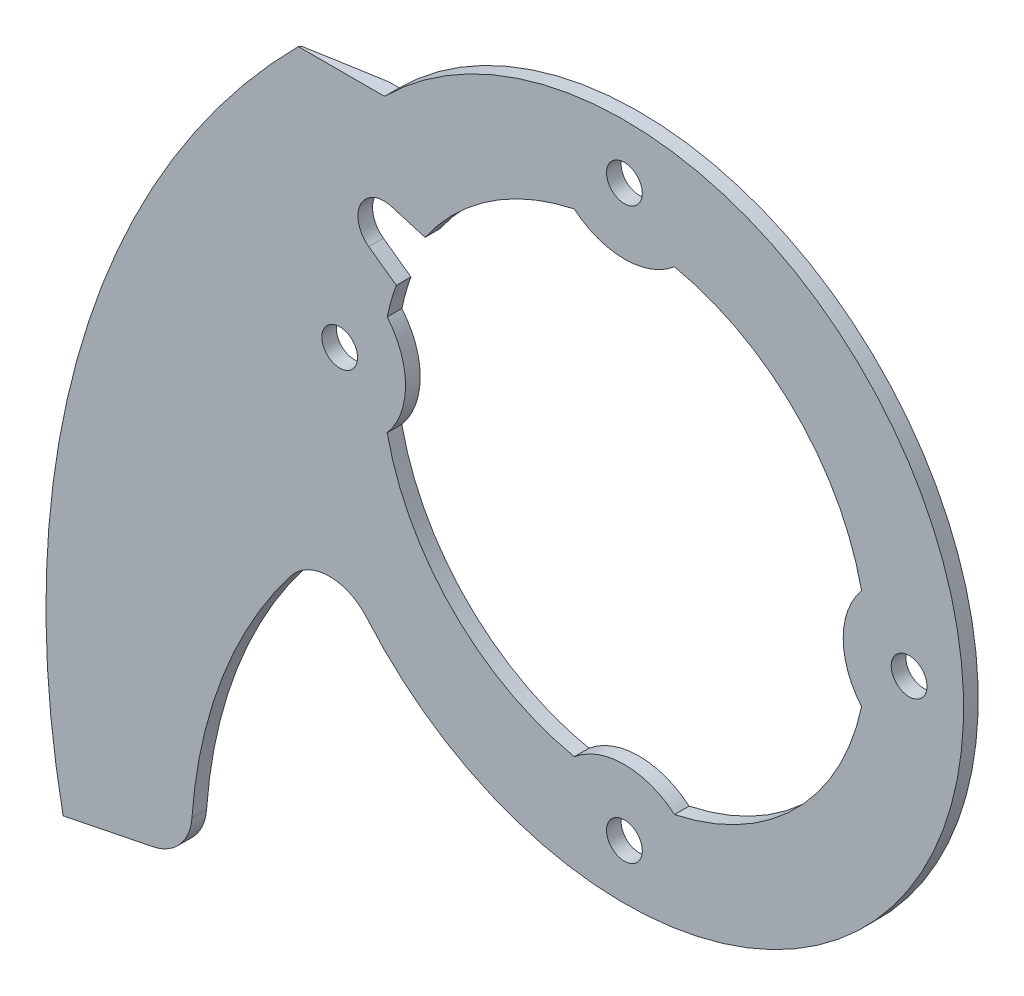
ISO-10303-21;
HEADER;
FILE_DESCRIPTION(('STEP AP214'),'2;1');
FILE_NAME('part.step','',(''),(''),'','','');
FILE_SCHEMA(('AUTOMOTIVE_DESIGN { 1 0 10303 214 1 1 1 1 }'));
ENDSEC;
DATA;
#1=APPLICATION_CONTEXT('core data for automotive mechanical design processes');
#2=APPLICATION_PROTOCOL_DEFINITION('international standard','automotive_design',2000,#1);
#3=PRODUCT_CONTEXT('',#1,'mechanical');
#4=PRODUCT('Part','Part','',(#3));
#5=PRODUCT_RELATED_PRODUCT_CATEGORY('part','',(#4));
#6=PRODUCT_DEFINITION_FORMATION('','',#4);
#7=PRODUCT_DEFINITION_CONTEXT('part definition',#1,'design');
#8=PRODUCT_DEFINITION('design','',#6,#7);
#9=PRODUCT_DEFINITION_SHAPE('','',#8);
#10=(LENGTH_UNIT() NAMED_UNIT(*) SI_UNIT(.MILLI.,.METRE.));
#11=(NAMED_UNIT(*) PLANE_ANGLE_UNIT() SI_UNIT($,.RADIAN.));
#12=(NAMED_UNIT(*) SI_UNIT($,.STERADIAN.) SOLID_ANGLE_UNIT());
#13=UNCERTAINTY_MEASURE_WITH_UNIT(LENGTH_MEASURE(1.E-05),#10,'distance_accuracy_value','');
#14=(GEOMETRIC_REPRESENTATION_CONTEXT(3) GLOBAL_UNCERTAINTY_ASSIGNED_CONTEXT((#13)) GLOBAL_UNIT_ASSIGNED_CONTEXT((#10,
#11,#12)) REPRESENTATION_CONTEXT('',''));
#15=CARTESIAN_POINT('',(0.,0.,0.));
#16=DIRECTION('',(0.,0.,1.));
#17=DIRECTION('',(1.,0.,0.));
#18=AXIS2_PLACEMENT_3D('',#15,#16,#17);
#19=CARTESIAN_POINT('',(0.,0.,0.));
#20=DIRECTION('',(0.,0.,1.));
#21=DIRECTION('',(1.,0.,0.));
#22=AXIS2_PLACEMENT_3D('',#19,#20,#21);
#23=PLANE('',#22);
#24=CARTESIAN_POINT('',(-1.83302770289265E-13,17.5,0.));
#25=DIRECTION('',(0.,0.,1.));
#26=DIRECTION('',(1.,0.,0.));
#27=AXIS2_PLACEMENT_3D('',#24,#25,#26);
#28=CIRCLE('',#27,1.1);
#29=CARTESIAN_POINT('',(1.09999999999982,17.5,0.));
#30=VERTEX_POINT('',#29);
#31=EDGE_CURVE('E196',#30,#30,#28,.T.);
#32=ORIENTED_EDGE('',*,*,#31,.T.);
#33=EDGE_LOOP('',(#32));
#34=FACE_BOUND('',#33,.T.);
#35=CARTESIAN_POINT('',(17.5,1.2220184685951E-13,0.));
#36=DIRECTION('',(0.,0.,1.));
#37=DIRECTION('',(1.,0.,0.));
#38=AXIS2_PLACEMENT_3D('',#35,#36,#37);
#39=CIRCLE('',#38,1.1);
#40=CARTESIAN_POINT('',(18.6,1.2220184685951E-13,0.));
#41=VERTEX_POINT('',#40);
#42=EDGE_CURVE('E391',#41,#41,#39,.T.);
#43=ORIENTED_EDGE('',*,*,#42,.T.);
#44=EDGE_LOOP('',(#43));
#45=FACE_BOUND('',#44,.T.);
#46=CARTESIAN_POINT('',(0.,-17.5,0.));
#47=DIRECTION('',(0.,0.,1.));
#48=DIRECTION('',(1.,0.,0.));
#49=AXIS2_PLACEMENT_3D('',#46,#47,#48);
#50=CIRCLE('',#49,1.1);
#51=CARTESIAN_POINT('',(1.10000000000006,-17.5,0.));
#52=VERTEX_POINT('',#51);
#53=EDGE_CURVE('E385',#52,#52,#50,.T.);
#54=ORIENTED_EDGE('',*,*,#53,.T.);
#55=EDGE_LOOP('',(#54));
#56=FACE_BOUND('',#55,.T.);
#57=CARTESIAN_POINT('',(-17.5,0.,0.));
#58=DIRECTION('',(0.,0.,1.));
#59=DIRECTION('',(1.,0.,0.));
#60=AXIS2_PLACEMENT_3D('',#57,#58,#59);
#61=CIRCLE('',#60,1.1);
#62=CARTESIAN_POINT('',(-16.4,0.,0.));
#63=VERTEX_POINT('',#62);
#64=EDGE_CURVE('E214',#63,#63,#61,.T.);
#65=ORIENTED_EDGE('',*,*,#64,.T.);
#66=EDGE_LOOP('',(#65));
#67=FACE_BOUND('',#66,.T.);
#68=CARTESIAN_POINT('',(0.,0.,0.));
#69=DIRECTION('',(0.,0.,1.));
#70=DIRECTION('',(1.,0.,0.));
#71=AXIS2_PLACEMENT_3D('',#68,#69,#70);
#72=CIRCLE('',#71,14.9);
#73=CARTESIAN_POINT('',(3.08048237185637,-14.5780872667398,0.));
#74=VERTEX_POINT('',#73);
#75=CARTESIAN_POINT('',(14.5780872667399,-3.08048237185623,0.));
#76=VERTEX_POINT('',#75);
#77=EDGE_CURVE('E453',#74,#76,#72,.T.);
#78=ORIENTED_EDGE('',*,*,#77,.T.);
#79=CARTESIAN_POINT('',(18.22,1.27229579987444E-13,0.));
#80=DIRECTION('',(0.,0.,1.));
#81=DIRECTION('',(1.,0.,0.));
#82=AXIS2_PLACEMENT_3D('',#79,#80,#81);
#83=CIRCLE('',#82,4.77);
#84=CARTESIAN_POINT('',(14.5780872667398,3.08048237185642,0.));
#85=VERTEX_POINT('',#84);
#86=EDGE_CURVE('E456',#85,#76,#83,.T.);
#87=ORIENTED_EDGE('',*,*,#86,.F.);
#88=CARTESIAN_POINT('',(0.,0.,0.));
#89=DIRECTION('',(0.,0.,1.));
#90=DIRECTION('',(1.,0.,0.));
#91=AXIS2_PLACEMENT_3D('',#88,#89,#90);
#92=CIRCLE('',#91,14.9);
#93=CARTESIAN_POINT('',(3.08048237185617,14.5780872667399,0.));
#94=VERTEX_POINT('',#93);
#95=EDGE_CURVE('E422',#85,#94,#92,.T.);
#96=ORIENTED_EDGE('',*,*,#95,.T.);
#97=CARTESIAN_POINT('',(-1.90844369981166E-13,18.22,0.));
#98=DIRECTION('',(0.,0.,1.));
#99=DIRECTION('',(1.,0.,0.));
#100=AXIS2_PLACEMENT_3D('',#97,#98,#99);
#101=CIRCLE('',#100,4.77);
#102=CARTESIAN_POINT('',(-3.08048237185648,14.5780872667398,0.));
#103=VERTEX_POINT('',#102);
#104=EDGE_CURVE('E426',#103,#94,#101,.T.);
#105=ORIENTED_EDGE('',*,*,#104,.F.);
#106=CARTESIAN_POINT('',(0.,0.,0.));
#107=DIRECTION('',(0.,0.,1.));
#108=DIRECTION('',(1.,0.,0.));
#109=AXIS2_PLACEMENT_3D('',#106,#107,#108);
#110=CIRCLE('',#109,14.9);
#111=CARTESIAN_POINT('',(-12.2522810940977,8.4788919082163,0.));
#112=VERTEX_POINT('',#111);
#113=EDGE_CURVE('E429',#103,#112,#110,.T.);
#114=ORIENTED_EDGE('',*,*,#113,.T.);
#115=DIRECTION('',(-0.958968900924998,0.28351128206599,0.));
#116=VECTOR('',#115,1.);
#117=CARTESIAN_POINT('',(-12.2522810940977,8.4788919082163,0.));
#118=LINE('',#117,#116);
#119=CARTESIAN_POINT('',(-14.3261550396902,9.09201571295183,0.));
#120=VERTEX_POINT('',#119);
#121=EDGE_CURVE('E432',#112,#120,#118,.T.);
#122=ORIENTED_EDGE('',*,*,#121,.T.);
#123=CARTESIAN_POINT('',(-14.7797730909958,7.55766547147183,0.));
#124=DIRECTION('',(0.,0.,1.));
#125=DIRECTION('',(1.,0.,0.));
#126=AXIS2_PLACEMENT_3D('',#123,#124,#125);
#127=CIRCLE('',#126,1.6);
#128=CARTESIAN_POINT('',(-15.7137076660313,6.25852490573111,0.));
#129=VERTEX_POINT('',#128);
#130=EDGE_CURVE('E435',#120,#129,#127,.T.);
#131=ORIENTED_EDGE('',*,*,#130,.T.);
#132=DIRECTION('',(0.811962853587954,-0.58370910939723,0.));
#133=VECTOR('',#132,1.);
#134=CARTESIAN_POINT('',(-15.7137076660313,6.25852490573111,0.));
#135=LINE('',#134,#133);
#136=CARTESIAN_POINT('',(-14.0210912628611,5.04172587498753,0.));
#137=VERTEX_POINT('',#136);
#138=EDGE_CURVE('E438',#129,#137,#135,.T.);
#139=ORIENTED_EDGE('',*,*,#138,.T.);
#140=CARTESIAN_POINT('',(0.,0.,0.));
#141=DIRECTION('',(0.,0.,1.));
#142=DIRECTION('',(1.,0.,0.));
#143=AXIS2_PLACEMENT_3D('',#140,#141,#142);
#144=CIRCLE('',#143,14.9);
#145=CARTESIAN_POINT('',(-14.5780872667398,3.08048237185632,0.));
#146=VERTEX_POINT('',#145);
#147=EDGE_CURVE('E441',#137,#146,#144,.T.);
#148=ORIENTED_EDGE('',*,*,#147,.T.);
#149=CARTESIAN_POINT('',(-18.22,0.,0.));
#150=DIRECTION('',(0.,0.,1.));
#151=DIRECTION('',(1.,0.,0.));
#152=AXIS2_PLACEMENT_3D('',#149,#150,#151);
#153=CIRCLE('',#152,4.77);
#154=CARTESIAN_POINT('',(-14.5780872667398,-3.08048237185632,0.));
#155=VERTEX_POINT('',#154);
#156=EDGE_CURVE('E444',#155,#146,#153,.T.);
#157=ORIENTED_EDGE('',*,*,#156,.F.);
#158=CARTESIAN_POINT('',(0.,0.,0.));
#159=DIRECTION('',(0.,0.,1.));
#160=DIRECTION('',(1.,0.,0.));
#161=AXIS2_PLACEMENT_3D('',#158,#159,#160);
#162=CIRCLE('',#161,14.9);
#163=CARTESIAN_POINT('',(-3.08048237185628,-14.5780872667399,0.));
#164=VERTEX_POINT('',#163);
#165=EDGE_CURVE('E447',#155,#164,#162,.T.);
#166=ORIENTED_EDGE('',*,*,#165,.T.);
#167=CARTESIAN_POINT('',(0.,-18.22,0.));
#168=DIRECTION('',(0.,0.,1.));
#169=DIRECTION('',(1.,0.,0.));
#170=AXIS2_PLACEMENT_3D('',#167,#168,#169);
#171=CIRCLE('',#170,4.77);
#172=EDGE_CURVE('E450',#74,#164,#171,.T.);
#173=ORIENTED_EDGE('',*,*,#172,.F.);
#174=EDGE_LOOP('',(#78,#87,#96,#105,#114,#122,#131,#139,#148,#157,#166,#173));
#175=FACE_BOUND('',#174,.T.);
#176=CARTESIAN_POINT('',(2.81403907886288,-31.6919290999345,0.));
#177=DIRECTION('',(0.,0.,-1.));
#178=DIRECTION('',(-1.,0.,0.));
#179=AXIS2_PLACEMENT_3D('',#176,#177,#178);
#180=CIRCLE('',#179,29.4703466385046);
#181=CARTESIAN_POINT('',(-26.5814833955898,-29.5932177220728,0.));
#182=VERTEX_POINT('',#181);
#183=CARTESIAN_POINT('',(-20.4997424891112,-13.6650347474839,0.));
#184=VERTEX_POINT('',#183);
#185=EDGE_CURVE('E211',#182,#184,#180,.T.);
#186=ORIENTED_EDGE('',*,*,#185,.F.);
#187=CARTESIAN_POINT('',(-29.5738665020762,-29.3795746926637,0.));
#188=DIRECTION('',(0.,0.,1.));
#189=DIRECTION('',(1.,0.,0.));
#190=AXIS2_PLACEMENT_3D('',#187,#188,#189);
#191=CIRCLE('',#190,3.);
#192=CARTESIAN_POINT('',(-28.9795506100121,-32.3201169250487,0.));
#193=VERTEX_POINT('',#192);
#194=EDGE_CURVE('E65',#182,#193,#191,.F.);
#195=ORIENTED_EDGE('',*,*,#194,.T.);
#196=DIRECTION('',(0.980180744128348,0.198105297354708,0.));
#197=VECTOR('',#196,1.);
#198=CARTESIAN_POINT('',(-34.4973270184311,-33.4353201594264,0.));
#199=LINE('',#198,#197);
#200=CARTESIAN_POINT('',(-31.3607486372207,-32.8013832078914,0.));
#201=VERTEX_POINT('',#200);
#202=EDGE_CURVE('E202',#201,#193,#199,.T.);
#203=ORIENTED_EDGE('',*,*,#202,.F.);
#204=CARTESIAN_POINT('',(17.7955101611227,-22.8663632389462,0.));
#205=DIRECTION('',(0.,0.,1.));
#206=DIRECTION('',(1.,0.,0.));
#207=AXIS2_PLACEMENT_3D('',#204,#205,#206);
#208=CIRCLE('',#207,50.1501984126984);
#209=CARTESIAN_POINT('',(-15.3792532879477,14.7431763877395,0.));
#210=VERTEX_POINT('',#209);
#211=EDGE_CURVE('E190',#210,#201,#208,.T.);
#212=ORIENTED_EDGE('',*,*,#211,.F.);
#213=DIRECTION('',(-1.,0.,0.));
#214=VECTOR('',#213,1.);
#215=CARTESIAN_POINT('',(-14.7431763877395,14.7431763877395,0.));
#216=LINE('',#215,#214);
#217=CARTESIAN_POINT('',(-14.7431763877395,14.7431763877395,0.));
#218=VERTEX_POINT('',#217);
#219=EDGE_CURVE('E200',#218,#210,#216,.T.);
#220=ORIENTED_EDGE('',*,*,#219,.F.);
#221=CARTESIAN_POINT('',(0.,0.,0.));
#222=DIRECTION('',(0.,0.,1.));
#223=DIRECTION('',(1.,0.,0.));
#224=AXIS2_PLACEMENT_3D('',#221,#222,#223);
#225=CIRCLE('',#224,20.85);
#226=CARTESIAN_POINT('',(-15.8464054880825,-13.5504218793094,0.));
#227=VERTEX_POINT('',#226);
#228=EDGE_CURVE('E221',#227,#218,#225,.T.);
#229=ORIENTED_EDGE('',*,*,#228,.F.);
#230=CARTESIAN_POINT('',(-18.1264638316915,-15.5001228691381,0.));
#231=DIRECTION('',(0.,0.,1.));
#232=DIRECTION('',(1.,0.,0.));
#233=AXIS2_PLACEMENT_3D('',#230,#231,#232);
#234=CIRCLE('',#233,3.);
#235=EDGE_CURVE('E361',#227,#184,#234,.T.);
#236=ORIENTED_EDGE('',*,*,#235,.T.);
#237=EDGE_LOOP('',(#186,#195,#203,#212,#220,#229,#236));
#238=FACE_BOUND('',#237,.T.);
#239=ADVANCED_FACE('F43',(#34,#45,#56,#67,#175,#238),#23,.F.);
#240=CARTESIAN_POINT('',(-14.7431763877395,14.7431763877395,0.9));
#241=DIRECTION('',(0.,-1.,0.));
#242=DIRECTION('',(1.,0.,0.));
#243=AXIS2_PLACEMENT_3D('',#240,#241,#242);
#244=PLANE('',#243);
#245=CARTESIAN_POINT('',(-29.0045307451094,14.7431763877395,2.47228321517367));
#246=CARTESIAN_POINT('',(-28.1997913728645,14.7431763877395,2.31546634436843));
#247=CARTESIAN_POINT('',(-27.3947558300821,14.7431763877395,2.16016901912033));
#248=CARTESIAN_POINT('',(-25.7840375169125,14.7431763877395,1.85294857123454));
#249=CARTESIAN_POINT('',(-24.9783547435261,14.7431763877395,1.70102546432701));
#250=CARTESIAN_POINT('',(-22.5604827175421,14.7431763877395,1.25086294431208));
#251=CARTESIAN_POINT('',(-20.9472519207941,14.7431763877395,0.958187695390044));
#252=CARTESIAN_POINT('',(-17.7175145492225,14.7431763877395,0.390934652341811));
#253=CARTESIAN_POINT('',(-16.1010078237409,14.7431763877395,0.116357710951419));
#254=CARTESIAN_POINT('',(-13.6734358481152,14.7431763877395,-0.278890461123842));
#255=CARTESIAN_POINT('',(-12.8637228371827,14.7431763877395,-0.407878301880907));
#256=CARTESIAN_POINT('',(-11.2433325589098,14.7431763877395,-0.659708892328115));
#257=CARTESIAN_POINT('',(-10.4326552800715,14.7431763877395,-0.782551567975229));
#258=CARTESIAN_POINT('',(-9.62147439762758,14.7431763877395,-0.902020733517472));
#259=B_SPLINE_CURVE_WITH_KNOTS('',3,(#245,#246,#247,#248,#249,#250,#251,#252,#253,#254,#255,
#256,#257,#258),.UNSPECIFIED.,.F.,.F.,(4,2,2,2,2,2,4),(0.,2.45962647980587,4.91926442366008,
9.83787442006183,14.7567160006101,17.2164625337879,19.6762386972907),.UNSPECIFIED.);
#260=CARTESIAN_POINT('',(-19.944627998937,14.7431763877395,0.782537434997381));
#261=VERTEX_POINT('',#260);
#262=EDGE_CURVE('E186',#261,#210,#259,.T.);
#263=ORIENTED_EDGE('',*,*,#262,.F.);
#264=CARTESIAN_POINT('',(-19.944627998937,14.7431763877395,0.782537434997381));
#265=CARTESIAN_POINT('',(-19.9610589387574,14.7431763877395,0.801935029559775));
#266=CARTESIAN_POINT('',(-19.9774867744012,14.7431763877395,0.821335251842588));
#267=CARTESIAN_POINT('',(-20.0103362373354,14.7431763877395,0.860140951848402));
#268=CARTESIAN_POINT('',(-20.0267578646257,14.7431763877395,0.879546429571403));
#269=CARTESIAN_POINT('',(-20.0431763877395,14.7431763877395,0.898954535014823));
#270=B_SPLINE_CURVE_WITH_KNOTS('',3,(#264,#265,#266,#267,#268,#269),.UNSPECIFIED.,.F.,.F.,(4,2,
4),(0.,0.0762638949770577,0.152527789951559),.UNSPECIFIED.);
#271=CARTESIAN_POINT('',(-20.0431763877395,14.7431763877395,0.898954535014825));
#272=VERTEX_POINT('',#271);
#273=EDGE_CURVE('E237',#261,#272,#270,.T.);
#274=ORIENTED_EDGE('',*,*,#273,.T.);
#275=DIRECTION('',(0.,0.,-1.));
#276=VECTOR('',#275,1.);
#277=CARTESIAN_POINT('',(-20.0431763877395,14.7431763877395,0.9));
#278=LINE('',#277,#276);
#279=CARTESIAN_POINT('',(-20.0431763877395,14.7431763877395,0.9));
#280=VERTEX_POINT('',#279);
#281=EDGE_CURVE('E227',#280,#272,#278,.T.);
#282=ORIENTED_EDGE('',*,*,#281,.F.);
#283=DIRECTION('',(-1.,0.,0.));
#284=VECTOR('',#283,1.);
#285=CARTESIAN_POINT('',(-14.7431763877395,14.7431763877395,0.9));
#286=LINE('',#285,#284);
#287=CARTESIAN_POINT('',(-14.7431763877395,14.7431763877395,0.9));
#288=VERTEX_POINT('',#287);
#289=EDGE_CURVE('E377',#288,#280,#286,.T.);
#290=ORIENTED_EDGE('',*,*,#289,.F.);
#291=DIRECTION('',(0.,0.,-1.));
#292=VECTOR('',#291,1.);
#293=CARTESIAN_POINT('',(-14.7431763877395,14.7431763877395,0.9));
#294=LINE('',#293,#292);
#295=EDGE_CURVE('E208',#288,#218,#294,.T.);
#296=ORIENTED_EDGE('',*,*,#295,.T.);
#297=ORIENTED_EDGE('',*,*,#219,.T.);
#298=EDGE_LOOP('',(#263,#274,#282,#290,#296,#297));
#299=FACE_BOUND('',#298,.T.);
#300=ADVANCED_FACE('F205',(#299),#244,.F.);
#301=CARTESIAN_POINT('',(17.7955101611227,-22.8663632389462,0.9));
#302=DIRECTION('',(0.,0.,-1.));
#303=DIRECTION('',(-1.,0.,0.));
#304=AXIS2_PLACEMENT_3D('',#301,#302,#303);
#305=CYLINDRICAL_SURFACE('',#304,53.3501984126984);
#306=ORIENTED_EDGE('',*,*,#281,.T.);
#307=CARTESIAN_POINT('',(17.7955101611227,-22.8663632389462,0.898954535014825));
#308=DIRECTION('',(0.,0.,-1.));
#309=DIRECTION('',(-1.,0.,0.));
#310=AXIS2_PLACEMENT_3D('',#307,#308,#309);
#311=CIRCLE('',#310,53.3501984126984);
#312=CARTESIAN_POINT('',(-34.4973270184311,-33.4353201594264,0.898954535014825));
#313=VERTEX_POINT('',#312);
#314=EDGE_CURVE('E231',#272,#313,#311,.F.);
#315=ORIENTED_EDGE('',*,*,#314,.T.);
#316=DIRECTION('',(0.,0.,-1.));
#317=VECTOR('',#316,1.);
#318=CARTESIAN_POINT('',(-34.4973270184311,-33.4353201594264,0.9));
#319=LINE('',#318,#317);
#320=CARTESIAN_POINT('',(-34.4973270184311,-33.4353201594264,0.9));
#321=VERTEX_POINT('',#320);
#322=EDGE_CURVE('E224',#321,#313,#319,.T.);
#323=ORIENTED_EDGE('',*,*,#322,.F.);
#324=CARTESIAN_POINT('',(17.7955101611227,-22.8663632389462,0.9));
#325=DIRECTION('',(0.,0.,1.));
#326=DIRECTION('',(1.,0.,0.));
#327=AXIS2_PLACEMENT_3D('',#324,#325,#326);
#328=CIRCLE('',#327,53.3501984126984);
#329=EDGE_CURVE('E376',#280,#321,#328,.T.);
#330=ORIENTED_EDGE('',*,*,#329,.F.);
#331=EDGE_LOOP('',(#306,#315,#323,#330));
#332=FACE_BOUND('',#331,.T.);
#333=ADVANCED_FACE('F252',(#332),#305,.T.);
#334=CARTESIAN_POINT('',(-34.4973270184311,-33.4353201594264,0.9));
#335=DIRECTION('',(-0.198105297354708,0.980180744128348,0.));
#336=DIRECTION('',(-0.980180744128348,-0.198105297354708,0.));
#337=AXIS2_PLACEMENT_3D('',#334,#335,#336);
#338=PLANE('',#337);
#339=ORIENTED_EDGE('',*,*,#202,.T.);
#340=DIRECTION('',(0.,0.,-1.));
#341=VECTOR('',#340,1.);
#342=CARTESIAN_POINT('',(-28.9795506100121,-32.3201169250487,0.9));
#343=LINE('',#342,#341);
#344=CARTESIAN_POINT('',(-28.9795506100121,-32.3201169250487,0.9));
#345=VERTEX_POINT('',#344);
#346=EDGE_CURVE('E51',#193,#345,#343,.F.);
#347=ORIENTED_EDGE('',*,*,#346,.T.);
#348=DIRECTION('',(0.980180744128348,0.198105297354708,0.));
#349=VECTOR('',#348,1.);
#350=CARTESIAN_POINT('',(-34.4973270184311,-33.4353201594264,0.9));
#351=LINE('',#350,#349);
#352=EDGE_CURVE('E375',#321,#345,#351,.T.);
#353=ORIENTED_EDGE('',*,*,#352,.F.);
#354=ORIENTED_EDGE('',*,*,#322,.T.);
#355=DIRECTION('',(-0.504298832405801,-0.1019243346167,0.857492925712562));
#356=VECTOR('',#355,1.);
#357=CARTESIAN_POINT('',(17.7955101611227,-22.8663632389461,-88.0180428194894));
#358=LINE('',#357,#356);
#359=CARTESIAN_POINT('',(-34.4288611385965,-33.4214824528967,0.782537434997383));
#360=VERTEX_POINT('',#359);
#361=EDGE_CURVE('E234',#313,#360,#358,.F.);
#362=ORIENTED_EDGE('',*,*,#361,.T.);
#363=DIRECTION('',(0.950914997702988,0.192190368467731,-0.242535625036333));
#364=VECTOR('',#363,1.);
#365=CARTESIAN_POINT('',(-34.4973270184311,-33.4353201594264,0.8));
#366=LINE('',#365,#364);
#367=EDGE_CURVE('E203',#360,#201,#366,.T.);
#368=ORIENTED_EDGE('',*,*,#367,.T.);
#369=EDGE_LOOP('',(#339,#347,#353,#354,#362,#368));
#370=FACE_BOUND('',#369,.T.);
#371=ADVANCED_FACE('F336',(#370),#338,.F.);
#372=CARTESIAN_POINT('',(0.,0.,0.9));
#373=DIRECTION('',(0.,0.,1.));
#374=DIRECTION('',(1.,0.,0.));
#375=AXIS2_PLACEMENT_3D('',#372,#373,#374);
#376=PLANE('',#375);
#377=CARTESIAN_POINT('',(17.5,1.2220184685951E-13,0.9));
#378=DIRECTION('',(0.,0.,1.));
#379=DIRECTION('',(1.,0.,0.));
#380=AXIS2_PLACEMENT_3D('',#377,#378,#379);
#381=CIRCLE('',#380,1.1);
#382=CARTESIAN_POINT('',(18.6,1.2220184685951E-13,0.9));
#383=VERTEX_POINT('',#382);
#384=EDGE_CURVE('E388',#383,#383,#381,.T.);
#385=ORIENTED_EDGE('',*,*,#384,.F.);
#386=EDGE_LOOP('',(#385));
#387=FACE_BOUND('',#386,.T.);
#388=CARTESIAN_POINT('',(-17.5,0.,0.9));
#389=DIRECTION('',(0.,0.,1.));
#390=DIRECTION('',(1.,0.,0.));
#391=AXIS2_PLACEMENT_3D('',#388,#389,#390);
#392=CIRCLE('',#391,1.1);
#393=CARTESIAN_POINT('',(-16.4,0.,0.9));
#394=VERTEX_POINT('',#393);
#395=EDGE_CURVE('E209',#394,#394,#392,.T.);
#396=ORIENTED_EDGE('',*,*,#395,.F.);
#397=EDGE_LOOP('',(#396));
#398=FACE_BOUND('',#397,.T.);
#399=ORIENTED_EDGE('',*,*,#352,.T.);
#400=CARTESIAN_POINT('',(-29.5738665020762,-29.3795746926637,0.9));
#401=DIRECTION('',(0.,0.,1.));
#402=DIRECTION('',(1.,0.,0.));
#403=AXIS2_PLACEMENT_3D('',#400,#401,#402);
#404=CIRCLE('',#403,3.);
#405=CARTESIAN_POINT('',(-26.5814833955898,-29.5932177220728,0.9));
#406=VERTEX_POINT('',#405);
#407=EDGE_CURVE('E11',#345,#406,#404,.T.);
#408=ORIENTED_EDGE('',*,*,#407,.T.);
#409=CARTESIAN_POINT('',(2.81403907886288,-31.6919290999345,0.9));
#410=DIRECTION('',(0.,0.,-1.));
#411=DIRECTION('',(-1.,0.,0.));
#412=AXIS2_PLACEMENT_3D('',#409,#410,#411);
#413=CIRCLE('',#412,29.4703466385046);
#414=CARTESIAN_POINT('',(-20.4997424891112,-13.6650347474839,0.9));
#415=VERTEX_POINT('',#414);
#416=EDGE_CURVE('E217',#406,#415,#413,.T.);
#417=ORIENTED_EDGE('',*,*,#416,.T.);
#418=CARTESIAN_POINT('',(-18.1264638316915,-15.5001228691381,0.9));
#419=DIRECTION('',(0.,0.,1.));
#420=DIRECTION('',(1.,0.,0.));
#421=AXIS2_PLACEMENT_3D('',#418,#419,#420);
#422=CIRCLE('',#421,3.);
#423=CARTESIAN_POINT('',(-15.8464054880825,-13.5504218793094,0.9));
#424=VERTEX_POINT('',#423);
#425=EDGE_CURVE('E359',#415,#424,#422,.F.);
#426=ORIENTED_EDGE('',*,*,#425,.T.);
#427=CARTESIAN_POINT('',(0.,0.,0.9));
#428=DIRECTION('',(0.,0.,1.));
#429=DIRECTION('',(1.,0.,0.));
#430=AXIS2_PLACEMENT_3D('',#427,#428,#429);
#431=CIRCLE('',#430,20.85);
#432=EDGE_CURVE('E223',#424,#288,#431,.T.);
#433=ORIENTED_EDGE('',*,*,#432,.T.);
#434=ORIENTED_EDGE('',*,*,#289,.T.);
#435=ORIENTED_EDGE('',*,*,#329,.T.);
#436=EDGE_LOOP('',(#399,#408,#417,#426,#433,#434,#435));
#437=FACE_BOUND('',#436,.T.);
#438=CARTESIAN_POINT('',(0.,-17.5,0.9));
#439=DIRECTION('',(0.,0.,1.));
#440=DIRECTION('',(1.,0.,0.));
#441=AXIS2_PLACEMENT_3D('',#438,#439,#440);
#442=CIRCLE('',#441,1.1);
#443=CARTESIAN_POINT('',(1.10000000000006,-17.5,0.9));
#444=VERTEX_POINT('',#443);
#445=EDGE_CURVE('E383',#444,#444,#442,.T.);
#446=ORIENTED_EDGE('',*,*,#445,.F.);
#447=EDGE_LOOP('',(#446));
#448=FACE_BOUND('',#447,.T.);
#449=CARTESIAN_POINT('',(18.22,1.27229579987444E-13,0.9));
#450=DIRECTION('',(0.,0.,1.));
#451=DIRECTION('',(1.,0.,0.));
#452=AXIS2_PLACEMENT_3D('',#449,#450,#451);
#453=CIRCLE('',#452,4.77);
#454=CARTESIAN_POINT('',(14.5780872667398,3.08048237185642,0.9));
#455=VERTEX_POINT('',#454);
#456=CARTESIAN_POINT('',(14.5780872667399,-3.08048237185623,0.9));
#457=VERTEX_POINT('',#456);
#458=EDGE_CURVE('E425',#455,#457,#453,.T.);
#459=ORIENTED_EDGE('',*,*,#458,.T.);
#460=CARTESIAN_POINT('',(0.,0.,0.9));
#461=DIRECTION('',(0.,0.,1.));
#462=DIRECTION('',(1.,0.,0.));
#463=AXIS2_PLACEMENT_3D('',#460,#461,#462);
#464=CIRCLE('',#463,14.9);
#465=CARTESIAN_POINT('',(3.08048237185637,-14.5780872667398,0.9));
#466=VERTEX_POINT('',#465);
#467=EDGE_CURVE('E480',#466,#457,#464,.T.);
#468=ORIENTED_EDGE('',*,*,#467,.F.);
#469=CARTESIAN_POINT('',(0.,-18.22,0.9));
#470=DIRECTION('',(0.,0.,1.));
#471=DIRECTION('',(1.,0.,0.));
#472=AXIS2_PLACEMENT_3D('',#469,#470,#471);
#473=CIRCLE('',#472,4.77);
#474=CARTESIAN_POINT('',(-3.08048237185628,-14.5780872667399,0.9));
#475=VERTEX_POINT('',#474);
#476=EDGE_CURVE('E477',#466,#475,#473,.T.);
#477=ORIENTED_EDGE('',*,*,#476,.T.);
#478=CARTESIAN_POINT('',(0.,0.,0.9));
#479=DIRECTION('',(0.,0.,1.));
#480=DIRECTION('',(1.,0.,0.));
#481=AXIS2_PLACEMENT_3D('',#478,#479,#480);
#482=CIRCLE('',#481,14.9);
#483=CARTESIAN_POINT('',(-14.5780872667398,-3.08048237185632,0.9));
#484=VERTEX_POINT('',#483);
#485=EDGE_CURVE('E475',#484,#475,#482,.T.);
#486=ORIENTED_EDGE('',*,*,#485,.F.);
#487=CARTESIAN_POINT('',(-18.22,0.,0.9));
#488=DIRECTION('',(0.,0.,1.));
#489=DIRECTION('',(1.,0.,0.));
#490=AXIS2_PLACEMENT_3D('',#487,#488,#489);
#491=CIRCLE('',#490,4.77);
#492=CARTESIAN_POINT('',(-14.5780872667398,3.08048237185632,0.9));
#493=VERTEX_POINT('',#492);
#494=EDGE_CURVE('E472',#484,#493,#491,.T.);
#495=ORIENTED_EDGE('',*,*,#494,.T.);
#496=CARTESIAN_POINT('',(0.,0.,0.9));
#497=DIRECTION('',(0.,0.,1.));
#498=DIRECTION('',(1.,0.,0.));
#499=AXIS2_PLACEMENT_3D('',#496,#497,#498);
#500=CIRCLE('',#499,14.9);
#501=CARTESIAN_POINT('',(-14.0210912628611,5.04172587498753,0.9));
#502=VERTEX_POINT('',#501);
#503=EDGE_CURVE('E470',#502,#493,#500,.T.);
#504=ORIENTED_EDGE('',*,*,#503,.F.);
#505=DIRECTION('',(0.811962853587954,-0.58370910939723,0.));
#506=VECTOR('',#505,1.);
#507=CARTESIAN_POINT('',(-15.7137076660313,6.25852490573111,0.9));
#508=LINE('',#507,#506);
#509=CARTESIAN_POINT('',(-15.7137076660313,6.25852490573111,0.9));
#510=VERTEX_POINT('',#509);
#511=EDGE_CURVE('E468',#510,#502,#508,.T.);
#512=ORIENTED_EDGE('',*,*,#511,.F.);
#513=CARTESIAN_POINT('',(-14.7797730909958,7.55766547147183,0.9));
#514=DIRECTION('',(0.,0.,1.));
#515=DIRECTION('',(1.,0.,0.));
#516=AXIS2_PLACEMENT_3D('',#513,#514,#515);
#517=CIRCLE('',#516,1.6);
#518=CARTESIAN_POINT('',(-14.3261550396902,9.09201571295183,0.9));
#519=VERTEX_POINT('',#518);
#520=EDGE_CURVE('E466',#519,#510,#517,.T.);
#521=ORIENTED_EDGE('',*,*,#520,.F.);
#522=DIRECTION('',(-0.958968900924998,0.28351128206599,0.));
#523=VECTOR('',#522,1.);
#524=CARTESIAN_POINT('',(-12.2522810940977,8.4788919082163,0.9));
#525=LINE('',#524,#523);
#526=CARTESIAN_POINT('',(-12.2522810940977,8.4788919082163,0.9));
#527=VERTEX_POINT('',#526);
#528=EDGE_CURVE('E464',#527,#519,#525,.T.);
#529=ORIENTED_EDGE('',*,*,#528,.F.);
#530=CARTESIAN_POINT('',(0.,0.,0.9));
#531=DIRECTION('',(0.,0.,1.));
#532=DIRECTION('',(1.,0.,0.));
#533=AXIS2_PLACEMENT_3D('',#530,#531,#532);
#534=CIRCLE('',#533,14.9);
#535=CARTESIAN_POINT('',(-3.08048237185648,14.5780872667398,0.9));
#536=VERTEX_POINT('',#535);
#537=EDGE_CURVE('E462',#536,#527,#534,.T.);
#538=ORIENTED_EDGE('',*,*,#537,.F.);
#539=CARTESIAN_POINT('',(-1.90844369981166E-13,18.22,0.9));
#540=DIRECTION('',(0.,0.,1.));
#541=DIRECTION('',(1.,0.,0.));
#542=AXIS2_PLACEMENT_3D('',#539,#540,#541);
#543=CIRCLE('',#542,4.77);
#544=CARTESIAN_POINT('',(3.08048237185617,14.5780872667399,0.9));
#545=VERTEX_POINT('',#544);
#546=EDGE_CURVE('E459',#536,#545,#543,.T.);
#547=ORIENTED_EDGE('',*,*,#546,.T.);
#548=CARTESIAN_POINT('',(0.,0.,0.9));
#549=DIRECTION('',(0.,0.,1.));
#550=DIRECTION('',(1.,0.,0.));
#551=AXIS2_PLACEMENT_3D('',#548,#549,#550);
#552=CIRCLE('',#551,14.9);
#553=EDGE_CURVE('E401',#455,#545,#552,.T.);
#554=ORIENTED_EDGE('',*,*,#553,.F.);
#555=EDGE_LOOP('',(#459,#468,#477,#486,#495,#504,#512,#521,#529,#538,#547,#554));
#556=FACE_BOUND('',#555,.T.);
#557=CARTESIAN_POINT('',(-1.83302770289265E-13,17.5,0.9));
#558=DIRECTION('',(0.,0.,1.));
#559=DIRECTION('',(1.,0.,0.));
#560=AXIS2_PLACEMENT_3D('',#557,#558,#559);
#561=CIRCLE('',#560,1.1);
#562=CARTESIAN_POINT('',(1.09999999999982,17.5,0.9));
#563=VERTEX_POINT('',#562);
#564=EDGE_CURVE('E262',#563,#563,#561,.T.);
#565=ORIENTED_EDGE('',*,*,#564,.F.);
#566=EDGE_LOOP('',(#565));
#567=FACE_BOUND('',#566,.T.);
#568=ADVANCED_FACE('F332',(#387,#398,#437,#448,#556,#567),#376,.T.);
#569=CARTESIAN_POINT('',(2.81403907886288,-31.6919290999345,0.9));
#570=DIRECTION('',(0.,0.,-1.));
#571=DIRECTION('',(-1.,0.,0.));
#572=AXIS2_PLACEMENT_3D('',#569,#570,#571);
#573=CYLINDRICAL_SURFACE('',#572,29.4703466385046);
#574=ORIENTED_EDGE('',*,*,#416,.F.);
#575=DIRECTION('',(0.,0.,-1.));
#576=VECTOR('',#575,1.);
#577=CARTESIAN_POINT('',(-26.5814833955898,-29.5932177220728,0.9));
#578=LINE('',#577,#576);
#579=EDGE_CURVE('E355',#406,#182,#578,.T.);
#580=ORIENTED_EDGE('',*,*,#579,.T.);
#581=ORIENTED_EDGE('',*,*,#185,.T.);
#582=DIRECTION('',(0.,0.,-1.));
#583=VECTOR('',#582,1.);
#584=CARTESIAN_POINT('',(-20.4997424891112,-13.6650347474839,0.9));
#585=LINE('',#584,#583);
#586=EDGE_CURVE('E363',#184,#415,#585,.F.);
#587=ORIENTED_EDGE('',*,*,#586,.T.);
#588=EDGE_LOOP('',(#574,#580,#581,#587));
#589=FACE_BOUND('',#588,.T.);
#590=ADVANCED_FACE('F335',(#589),#573,.F.);
#591=CARTESIAN_POINT('',(0.,0.,0.9));
#592=DIRECTION('',(0.,0.,-1.));
#593=DIRECTION('',(-1.,0.,0.));
#594=AXIS2_PLACEMENT_3D('',#591,#592,#593);
#595=CYLINDRICAL_SURFACE('',#594,20.85);
#596=ORIENTED_EDGE('',*,*,#432,.F.);
#597=DIRECTION('',(0.,0.,-1.));
#598=VECTOR('',#597,1.);
#599=CARTESIAN_POINT('',(-15.8464054880825,-13.5504218793094,0.9));
#600=LINE('',#599,#598);
#601=EDGE_CURVE('E245',#424,#227,#600,.T.);
#602=ORIENTED_EDGE('',*,*,#601,.T.);
#603=ORIENTED_EDGE('',*,*,#228,.T.);
#604=ORIENTED_EDGE('',*,*,#295,.F.);
#605=EDGE_LOOP('',(#596,#602,#603,#604));
#606=FACE_BOUND('',#605,.T.);
#607=ADVANCED_FACE('F330',(#606),#595,.T.);
#608=CARTESIAN_POINT('',(-17.5,0.,0.9));
#609=DIRECTION('',(0.,0.,-1.));
#610=DIRECTION('',(-1.,0.,0.));
#611=AXIS2_PLACEMENT_3D('',#608,#609,#610);
#612=CYLINDRICAL_SURFACE('',#611,1.1);
#613=ORIENTED_EDGE('',*,*,#395,.T.);
#614=EDGE_LOOP('',(#613));
#615=FACE_BOUND('',#614,.T.);
#616=ORIENTED_EDGE('',*,*,#64,.F.);
#617=EDGE_LOOP('',(#616));
#618=FACE_BOUND('',#617,.T.);
#619=ADVANCED_FACE('F326',(#615,#618),#612,.F.);
#620=CARTESIAN_POINT('',(0.,-17.5,0.9));
#621=DIRECTION('',(0.,0.,-1.));
#622=DIRECTION('',(-1.,0.,0.));
#623=AXIS2_PLACEMENT_3D('',#620,#621,#622);
#624=CYLINDRICAL_SURFACE('',#623,1.1);
#625=ORIENTED_EDGE('',*,*,#445,.T.);
#626=EDGE_LOOP('',(#625));
#627=FACE_BOUND('',#626,.T.);
#628=ORIENTED_EDGE('',*,*,#53,.F.);
#629=EDGE_LOOP('',(#628));
#630=FACE_BOUND('',#629,.T.);
#631=ADVANCED_FACE('F322',(#627,#630),#624,.F.);
#632=CARTESIAN_POINT('',(17.5,1.2220184685951E-13,0.9));
#633=DIRECTION('',(0.,0.,-1.));
#634=DIRECTION('',(-1.,0.,0.));
#635=AXIS2_PLACEMENT_3D('',#632,#633,#634);
#636=CYLINDRICAL_SURFACE('',#635,1.1);
#637=ORIENTED_EDGE('',*,*,#384,.T.);
#638=EDGE_LOOP('',(#637));
#639=FACE_BOUND('',#638,.T.);
#640=ORIENTED_EDGE('',*,*,#42,.F.);
#641=EDGE_LOOP('',(#640));
#642=FACE_BOUND('',#641,.T.);
#643=ADVANCED_FACE('F318',(#639,#642),#636,.F.);
#644=CARTESIAN_POINT('',(18.22,1.27229579987444E-13,0.9));
#645=DIRECTION('',(0.,0.,-1.));
#646=DIRECTION('',(-1.,0.,0.));
#647=AXIS2_PLACEMENT_3D('',#644,#645,#646);
#648=CYLINDRICAL_SURFACE('',#647,4.77);
#649=ORIENTED_EDGE('',*,*,#86,.T.);
#650=DIRECTION('',(0.,0.,-1.));
#651=VECTOR('',#650,1.);
#652=CARTESIAN_POINT('',(14.5780872667399,-3.08048237185623,0.9));
#653=LINE('',#652,#651);
#654=EDGE_CURVE('E397',#457,#76,#653,.T.);
#655=ORIENTED_EDGE('',*,*,#654,.F.);
#656=ORIENTED_EDGE('',*,*,#458,.F.);
#657=DIRECTION('',(0.,0.,-1.));
#658=VECTOR('',#657,1.);
#659=CARTESIAN_POINT('',(14.5780872667398,3.08048237185642,0.9));
#660=LINE('',#659,#658);
#661=EDGE_CURVE('E394',#455,#85,#660,.T.);
#662=ORIENTED_EDGE('',*,*,#661,.T.);
#663=EDGE_LOOP('',(#649,#655,#656,#662));
#664=FACE_BOUND('',#663,.T.);
#665=ADVANCED_FACE('F276',(#664),#648,.T.);
#666=CARTESIAN_POINT('',(0.,0.,0.9));
#667=DIRECTION('',(0.,0.,-1.));
#668=DIRECTION('',(-1.,0.,0.));
#669=AXIS2_PLACEMENT_3D('',#666,#667,#668);
#670=CYLINDRICAL_SURFACE('',#669,14.9);
#671=ORIENTED_EDGE('',*,*,#95,.F.);
#672=ORIENTED_EDGE('',*,*,#661,.F.);
#673=ORIENTED_EDGE('',*,*,#553,.T.);
#674=DIRECTION('',(0.,0.,-1.));
#675=VECTOR('',#674,1.);
#676=CARTESIAN_POINT('',(3.08048237185617,14.5780872667399,0.9));
#677=LINE('',#676,#675);
#678=EDGE_CURVE('E419',#545,#94,#677,.T.);
#679=ORIENTED_EDGE('',*,*,#678,.T.);
#680=EDGE_LOOP('',(#671,#672,#673,#679));
#681=FACE_BOUND('',#680,.T.);
#682=ADVANCED_FACE('F272',(#681),#670,.F.);
#683=CARTESIAN_POINT('',(-1.90844369981166E-13,18.22,0.9));
#684=DIRECTION('',(0.,0.,-1.));
#685=DIRECTION('',(-1.,0.,0.));
#686=AXIS2_PLACEMENT_3D('',#683,#684,#685);
#687=CYLINDRICAL_SURFACE('',#686,4.77);
#688=ORIENTED_EDGE('',*,*,#104,.T.);
#689=ORIENTED_EDGE('',*,*,#678,.F.);
#690=ORIENTED_EDGE('',*,*,#546,.F.);
#691=DIRECTION('',(0.,0.,-1.));
#692=VECTOR('',#691,1.);
#693=CARTESIAN_POINT('',(-3.08048237185648,14.5780872667398,0.9));
#694=LINE('',#693,#692);
#695=EDGE_CURVE('E417',#536,#103,#694,.T.);
#696=ORIENTED_EDGE('',*,*,#695,.T.);
#697=EDGE_LOOP('',(#688,#689,#690,#696));
#698=FACE_BOUND('',#697,.T.);
#699=ADVANCED_FACE('F275',(#698),#687,.T.);
#700=CARTESIAN_POINT('',(0.,0.,0.9));
#701=DIRECTION('',(0.,0.,-1.));
#702=DIRECTION('',(-1.,0.,0.));
#703=AXIS2_PLACEMENT_3D('',#700,#701,#702);
#704=CYLINDRICAL_SURFACE('',#703,14.9);
#705=ORIENTED_EDGE('',*,*,#113,.F.);
#706=ORIENTED_EDGE('',*,*,#695,.F.);
#707=ORIENTED_EDGE('',*,*,#537,.T.);
#708=DIRECTION('',(0.,0.,-1.));
#709=VECTOR('',#708,1.);
#710=CARTESIAN_POINT('',(-12.2522810940977,8.4788919082163,0.9));
#711=LINE('',#710,#709);
#712=EDGE_CURVE('E415',#527,#112,#711,.T.);
#713=ORIENTED_EDGE('',*,*,#712,.T.);
#714=EDGE_LOOP('',(#705,#706,#707,#713));
#715=FACE_BOUND('',#714,.T.);
#716=ADVANCED_FACE('F280',(#715),#704,.F.);
#717=CARTESIAN_POINT('',(-12.2522810940977,8.4788919082163,0.9));
#718=DIRECTION('',(-0.28351128206599,-0.958968900924998,0.));
#719=DIRECTION('',(0.958968900924998,-0.28351128206599,0.));
#720=AXIS2_PLACEMENT_3D('',#717,#718,#719);
#721=PLANE('',#720);
#722=ORIENTED_EDGE('',*,*,#121,.F.);
#723=ORIENTED_EDGE('',*,*,#712,.F.);
#724=ORIENTED_EDGE('',*,*,#528,.T.);
#725=DIRECTION('',(0.,0.,-1.));
#726=VECTOR('',#725,1.);
#727=CARTESIAN_POINT('',(-14.3261550396902,9.09201571295183,0.9));
#728=LINE('',#727,#726);
#729=EDGE_CURVE('E413',#519,#120,#728,.T.);
#730=ORIENTED_EDGE('',*,*,#729,.T.);
#731=EDGE_LOOP('',(#722,#723,#724,#730));
#732=FACE_BOUND('',#731,.T.);
#733=ADVANCED_FACE('F284',(#732),#721,.T.);
#734=CARTESIAN_POINT('',(-14.7797730909958,7.55766547147183,0.9));
#735=DIRECTION('',(0.,0.,-1.));
#736=DIRECTION('',(-1.,0.,0.));
#737=AXIS2_PLACEMENT_3D('',#734,#735,#736);
#738=CYLINDRICAL_SURFACE('',#737,1.6);
#739=ORIENTED_EDGE('',*,*,#130,.F.);
#740=ORIENTED_EDGE('',*,*,#729,.F.);
#741=ORIENTED_EDGE('',*,*,#520,.T.);
#742=DIRECTION('',(0.,0.,-1.));
#743=VECTOR('',#742,1.);
#744=CARTESIAN_POINT('',(-15.7137076660313,6.25852490573111,0.9));
#745=LINE('',#744,#743);
#746=EDGE_CURVE('E411',#510,#129,#745,.T.);
#747=ORIENTED_EDGE('',*,*,#746,.T.);
#748=EDGE_LOOP('',(#739,#740,#741,#747));
#749=FACE_BOUND('',#748,.T.);
#750=ADVANCED_FACE('F288',(#749),#738,.F.);
#751=CARTESIAN_POINT('',(-15.7137076660313,6.25852490573111,0.9));
#752=DIRECTION('',(0.58370910939723,0.811962853587954,0.));
#753=DIRECTION('',(-0.811962853587954,0.58370910939723,0.));
#754=AXIS2_PLACEMENT_3D('',#751,#752,#753);
#755=PLANE('',#754);
#756=ORIENTED_EDGE('',*,*,#138,.F.);
#757=ORIENTED_EDGE('',*,*,#746,.F.);
#758=ORIENTED_EDGE('',*,*,#511,.T.);
#759=DIRECTION('',(0.,0.,-1.));
#760=VECTOR('',#759,1.);
#761=CARTESIAN_POINT('',(-14.0210912628611,5.04172587498753,0.9));
#762=LINE('',#761,#760);
#763=EDGE_CURVE('E409',#502,#137,#762,.T.);
#764=ORIENTED_EDGE('',*,*,#763,.T.);
#765=EDGE_LOOP('',(#756,#757,#758,#764));
#766=FACE_BOUND('',#765,.T.);
#767=ADVANCED_FACE('F292',(#766),#755,.T.);
#768=CARTESIAN_POINT('',(0.,0.,0.9));
#769=DIRECTION('',(0.,0.,-1.));
#770=DIRECTION('',(-1.,0.,0.));
#771=AXIS2_PLACEMENT_3D('',#768,#769,#770);
#772=CYLINDRICAL_SURFACE('',#771,14.9);
#773=ORIENTED_EDGE('',*,*,#147,.F.);
#774=ORIENTED_EDGE('',*,*,#763,.F.);
#775=ORIENTED_EDGE('',*,*,#503,.T.);
#776=DIRECTION('',(0.,0.,-1.));
#777=VECTOR('',#776,1.);
#778=CARTESIAN_POINT('',(-14.5780872667398,3.08048237185632,0.9));
#779=LINE('',#778,#777);
#780=EDGE_CURVE('E407',#493,#146,#779,.T.);
#781=ORIENTED_EDGE('',*,*,#780,.T.);
#782=EDGE_LOOP('',(#773,#774,#775,#781));
#783=FACE_BOUND('',#782,.T.);
#784=ADVANCED_FACE('F296',(#783),#772,.F.);
#785=CARTESIAN_POINT('',(-18.22,0.,0.9));
#786=DIRECTION('',(0.,0.,-1.));
#787=DIRECTION('',(-1.,0.,0.));
#788=AXIS2_PLACEMENT_3D('',#785,#786,#787);
#789=CYLINDRICAL_SURFACE('',#788,4.77);
#790=ORIENTED_EDGE('',*,*,#156,.T.);
#791=ORIENTED_EDGE('',*,*,#780,.F.);
#792=ORIENTED_EDGE('',*,*,#494,.F.);
#793=DIRECTION('',(0.,0.,-1.));
#794=VECTOR('',#793,1.);
#795=CARTESIAN_POINT('',(-14.5780872667398,-3.08048237185632,0.9));
#796=LINE('',#795,#794);
#797=EDGE_CURVE('E405',#484,#155,#796,.T.);
#798=ORIENTED_EDGE('',*,*,#797,.T.);
#799=EDGE_LOOP('',(#790,#791,#792,#798));
#800=FACE_BOUND('',#799,.T.);
#801=ADVANCED_FACE('F300',(#800),#789,.T.);
#802=CARTESIAN_POINT('',(0.,0.,0.9));
#803=DIRECTION('',(0.,0.,-1.));
#804=DIRECTION('',(-1.,0.,0.));
#805=AXIS2_PLACEMENT_3D('',#802,#803,#804);
#806=CYLINDRICAL_SURFACE('',#805,14.9);
#807=ORIENTED_EDGE('',*,*,#165,.F.);
#808=ORIENTED_EDGE('',*,*,#797,.F.);
#809=ORIENTED_EDGE('',*,*,#485,.T.);
#810=DIRECTION('',(0.,0.,-1.));
#811=VECTOR('',#810,1.);
#812=CARTESIAN_POINT('',(-3.08048237185628,-14.5780872667399,0.9));
#813=LINE('',#812,#811);
#814=EDGE_CURVE('E403',#475,#164,#813,.T.);
#815=ORIENTED_EDGE('',*,*,#814,.T.);
#816=EDGE_LOOP('',(#807,#808,#809,#815));
#817=FACE_BOUND('',#816,.T.);
#818=ADVANCED_FACE('F304',(#817),#806,.F.);
#819=CARTESIAN_POINT('',(0.,-18.22,0.9));
#820=DIRECTION('',(0.,0.,-1.));
#821=DIRECTION('',(-1.,0.,0.));
#822=AXIS2_PLACEMENT_3D('',#819,#820,#821);
#823=CYLINDRICAL_SURFACE('',#822,4.77);
#824=ORIENTED_EDGE('',*,*,#172,.T.);
#825=ORIENTED_EDGE('',*,*,#814,.F.);
#826=ORIENTED_EDGE('',*,*,#476,.F.);
#827=DIRECTION('',(0.,0.,-1.));
#828=VECTOR('',#827,1.);
#829=CARTESIAN_POINT('',(3.08048237185637,-14.5780872667398,0.9));
#830=LINE('',#829,#828);
#831=EDGE_CURVE('E400',#466,#74,#830,.T.);
#832=ORIENTED_EDGE('',*,*,#831,.T.);
#833=EDGE_LOOP('',(#824,#825,#826,#832));
#834=FACE_BOUND('',#833,.T.);
#835=ADVANCED_FACE('F308',(#834),#823,.T.);
#836=CARTESIAN_POINT('',(0.,0.,0.9));
#837=DIRECTION('',(0.,0.,-1.));
#838=DIRECTION('',(-1.,0.,0.));
#839=AXIS2_PLACEMENT_3D('',#836,#837,#838);
#840=CYLINDRICAL_SURFACE('',#839,14.9);
#841=ORIENTED_EDGE('',*,*,#77,.F.);
#842=ORIENTED_EDGE('',*,*,#831,.F.);
#843=ORIENTED_EDGE('',*,*,#467,.T.);
#844=ORIENTED_EDGE('',*,*,#654,.T.);
#845=EDGE_LOOP('',(#841,#842,#843,#844));
#846=FACE_BOUND('',#845,.T.);
#847=ADVANCED_FACE('F270',(#846),#840,.F.);
#848=CARTESIAN_POINT('',(-1.83302770289265E-13,17.5,0.9));
#849=DIRECTION('',(0.,0.,-1.));
#850=DIRECTION('',(-1.,0.,0.));
#851=AXIS2_PLACEMENT_3D('',#848,#849,#850);
#852=CYLINDRICAL_SURFACE('',#851,1.1);
#853=ORIENTED_EDGE('',*,*,#564,.T.);
#854=EDGE_LOOP('',(#853));
#855=FACE_BOUND('',#854,.T.);
#856=ORIENTED_EDGE('',*,*,#31,.F.);
#857=EDGE_LOOP('',(#856));
#858=FACE_BOUND('',#857,.T.);
#859=ADVANCED_FACE('F267',(#855,#858),#852,.F.);
#860=CARTESIAN_POINT('',(17.7955101611227,-22.8663632389462,0.8));
#861=DIRECTION('',(0.,0.,1.));
#862=DIRECTION('',(1.,0.,0.));
#863=AXIS2_PLACEMENT_3D('',#860,#861,#862);
#864=CONICAL_SURFACE('',#863,53.3501984126984,1.32581766366803);
#865=ORIENTED_EDGE('',*,*,#367,.F.);
#866=CARTESIAN_POINT('',(17.7955101611227,-22.8663632389462,0.782537434997399));
#867=DIRECTION('',(0.,0.,1.));
#868=DIRECTION('',(1.,0.,0.));
#869=AXIS2_PLACEMENT_3D('',#866,#867,#868);
#870=CIRCLE('',#869,53.2803481526879);
#871=EDGE_CURVE('E192',#360,#261,#870,.F.);
#872=ORIENTED_EDGE('',*,*,#871,.T.);
#873=ORIENTED_EDGE('',*,*,#262,.T.);
#874=ORIENTED_EDGE('',*,*,#211,.T.);
#875=EDGE_LOOP('',(#865,#872,#873,#874));
#876=FACE_BOUND('',#875,.T.);
#877=ADVANCED_FACE('F189',(#876),#864,.T.);
#878=CARTESIAN_POINT('',(17.7955101611227,-22.8663632389462,0.898954535014825));
#879=DIRECTION('',(0.,0.,1.));
#880=DIRECTION('',(1.,0.,0.));
#881=AXIS2_PLACEMENT_3D('',#878,#879,#880);
#882=CONICAL_SURFACE('',#881,53.3501984126984,0.54041950027055);
#883=ORIENTED_EDGE('',*,*,#273,.F.);
#884=ORIENTED_EDGE('',*,*,#871,.F.);
#885=ORIENTED_EDGE('',*,*,#361,.F.);
#886=ORIENTED_EDGE('',*,*,#314,.F.);
#887=EDGE_LOOP('',(#883,#884,#885,#886));
#888=FACE_BOUND('',#887,.T.);
#889=ADVANCED_FACE('F247',(#888),#882,.T.);
#890=CARTESIAN_POINT('',(-18.1264638316915,-15.5001228691381,0.9));
#891=DIRECTION('',(0.,0.,-1.));
#892=DIRECTION('',(-1.,0.,0.));
#893=AXIS2_PLACEMENT_3D('',#890,#891,#892);
#894=CYLINDRICAL_SURFACE('',#893,3.);
#895=ORIENTED_EDGE('',*,*,#425,.F.);
#896=ORIENTED_EDGE('',*,*,#586,.F.);
#897=ORIENTED_EDGE('',*,*,#235,.F.);
#898=ORIENTED_EDGE('',*,*,#601,.F.);
#899=EDGE_LOOP('',(#895,#896,#897,#898));
#900=FACE_BOUND('',#899,.T.);
#901=ADVANCED_FACE('F372',(#900),#894,.F.);
#902=CARTESIAN_POINT('',(-29.5738665020762,-29.3795746926637,0.9));
#903=DIRECTION('',(0.,0.,-1.));
#904=DIRECTION('',(-1.,0.,0.));
#905=AXIS2_PLACEMENT_3D('',#902,#903,#904);
#906=CYLINDRICAL_SURFACE('',#905,3.);
#907=ORIENTED_EDGE('',*,*,#407,.F.);
#908=ORIENTED_EDGE('',*,*,#346,.F.);
#909=ORIENTED_EDGE('',*,*,#194,.F.);
#910=ORIENTED_EDGE('',*,*,#579,.F.);
#911=EDGE_LOOP('',(#907,#908,#909,#910));
#912=FACE_BOUND('',#911,.T.);
#913=ADVANCED_FACE('F45',(#912),#906,.T.);
#914=CLOSED_SHELL('',(#239,#300,#333,#371,#568,#590,#607,#619,#631,#643,#665,#682,#699,#716,
#733,#750,#767,#784,#801,#818,#835,#847,#859,#877,#889,#901,#913));
#915=MANIFOLD_SOLID_BREP('B2',#914);
#916=ADVANCED_BREP_SHAPE_REPRESENTATION('',(#18,#915),#14);
#917=SHAPE_DEFINITION_REPRESENTATION(#9,#916);
ENDSEC;
END-ISO-10303-21;
